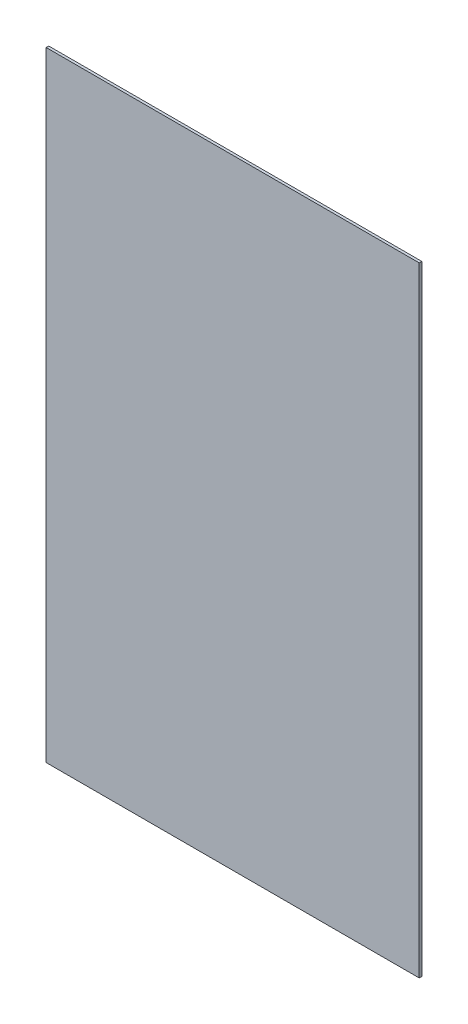
ISO-10303-21;
HEADER;
FILE_DESCRIPTION(('STEP AP214'),'2;1');
FILE_NAME('part.step','',(''),(''),'','','');
FILE_SCHEMA(('AUTOMOTIVE_DESIGN { 1 0 10303 214 1 1 1 1 }'));
ENDSEC;
DATA;
#1=APPLICATION_CONTEXT('core data for automotive mechanical design processes');
#2=APPLICATION_PROTOCOL_DEFINITION('international standard','automotive_design',2000,#1);
#3=PRODUCT_CONTEXT('',#1,'mechanical');
#4=PRODUCT('Part','Part','',(#3));
#5=PRODUCT_RELATED_PRODUCT_CATEGORY('part','',(#4));
#6=PRODUCT_DEFINITION_FORMATION('','',#4);
#7=PRODUCT_DEFINITION_CONTEXT('part definition',#1,'design');
#8=PRODUCT_DEFINITION('design','',#6,#7);
#9=PRODUCT_DEFINITION_SHAPE('','',#8);
#10=(LENGTH_UNIT() NAMED_UNIT(*) SI_UNIT(.MILLI.,.METRE.));
#11=(NAMED_UNIT(*) PLANE_ANGLE_UNIT() SI_UNIT($,.RADIAN.));
#12=(NAMED_UNIT(*) SI_UNIT($,.STERADIAN.) SOLID_ANGLE_UNIT());
#13=UNCERTAINTY_MEASURE_WITH_UNIT(LENGTH_MEASURE(1.E-05),#10,'distance_accuracy_value','');
#14=(GEOMETRIC_REPRESENTATION_CONTEXT(3) GLOBAL_UNCERTAINTY_ASSIGNED_CONTEXT((#13)) GLOBAL_UNIT_ASSIGNED_CONTEXT((#10,
#11,#12)) REPRESENTATION_CONTEXT('',''));
#15=CARTESIAN_POINT('',(0.,0.,0.));
#16=DIRECTION('',(0.,0.,1.));
#17=DIRECTION('',(1.,0.,0.));
#18=AXIS2_PLACEMENT_3D('',#15,#16,#17);
#19=CARTESIAN_POINT('',(0.,0.,3.175));
#20=DIRECTION('',(1.,0.,0.));
#21=DIRECTION('',(0.,0.,-1.));
#22=AXIS2_PLACEMENT_3D('',#19,#20,#21);
#23=PLANE('',#22);
#24=DIRECTION('',(0.,-1.,0.));
#25=VECTOR('',#24,1.);
#26=CARTESIAN_POINT('',(0.,0.,0.));
#27=LINE('',#26,#25);
#28=CARTESIAN_POINT('',(0.,758.9266,0.));
#29=VERTEX_POINT('',#28);
#30=CARTESIAN_POINT('',(0.,0.,0.));
#31=VERTEX_POINT('',#30);
#32=EDGE_CURVE('E96',#29,#31,#27,.T.);
#33=ORIENTED_EDGE('',*,*,#32,.T.);
#34=DIRECTION('',(0.,0.,-1.));
#35=VECTOR('',#34,1.);
#36=CARTESIAN_POINT('',(0.,0.,3.175));
#37=LINE('',#36,#35);
#38=CARTESIAN_POINT('',(0.,0.,3.175));
#39=VERTEX_POINT('',#38);
#40=EDGE_CURVE('E11',#39,#31,#37,.T.);
#41=ORIENTED_EDGE('',*,*,#40,.F.);
#42=DIRECTION('',(0.,-1.,0.));
#43=VECTOR('',#42,1.);
#44=CARTESIAN_POINT('',(0.,0.,3.175));
#45=LINE('',#44,#43);
#46=CARTESIAN_POINT('',(0.,758.9266,3.175));
#47=VERTEX_POINT('',#46);
#48=EDGE_CURVE('E84',#47,#39,#45,.T.);
#49=ORIENTED_EDGE('',*,*,#48,.F.);
#50=DIRECTION('',(0.,0.,-1.));
#51=VECTOR('',#50,1.);
#52=CARTESIAN_POINT('',(0.,758.9266,3.175));
#53=LINE('',#52,#51);
#54=EDGE_CURVE('E92',#47,#29,#53,.T.);
#55=ORIENTED_EDGE('',*,*,#54,.T.);
#56=EDGE_LOOP('',(#33,#41,#49,#55));
#57=FACE_BOUND('',#56,.T.);
#58=ADVANCED_FACE('F33',(#57),#23,.F.);
#59=CARTESIAN_POINT('',(0.,0.,3.175));
#60=DIRECTION('',(0.,1.,0.));
#61=DIRECTION('',(0.,0.,1.));
#62=AXIS2_PLACEMENT_3D('',#59,#60,#61);
#63=PLANE('',#62);
#64=DIRECTION('',(1.,0.,0.));
#65=VECTOR('',#64,1.);
#66=CARTESIAN_POINT('',(0.,0.,0.));
#67=LINE('',#66,#65);
#68=CARTESIAN_POINT('',(457.2,0.,0.));
#69=VERTEX_POINT('',#68);
#70=EDGE_CURVE('E88',#31,#69,#67,.T.);
#71=ORIENTED_EDGE('',*,*,#70,.T.);
#72=DIRECTION('',(0.,0.,-1.));
#73=VECTOR('',#72,1.);
#74=CARTESIAN_POINT('',(457.2,0.,3.175));
#75=LINE('',#74,#73);
#76=CARTESIAN_POINT('',(457.2,0.,3.175));
#77=VERTEX_POINT('',#76);
#78=EDGE_CURVE('E41',#77,#69,#75,.T.);
#79=ORIENTED_EDGE('',*,*,#78,.F.);
#80=DIRECTION('',(1.,0.,0.));
#81=VECTOR('',#80,1.);
#82=CARTESIAN_POINT('',(0.,0.,3.175));
#83=LINE('',#82,#81);
#84=EDGE_CURVE('E79',#39,#77,#83,.T.);
#85=ORIENTED_EDGE('',*,*,#84,.F.);
#86=ORIENTED_EDGE('',*,*,#40,.T.);
#87=EDGE_LOOP('',(#71,#79,#85,#86));
#88=FACE_BOUND('',#87,.T.);
#89=ADVANCED_FACE('F87',(#88),#63,.F.);
#90=CARTESIAN_POINT('',(457.2,0.,3.175));
#91=DIRECTION('',(-1.,0.,0.));
#92=DIRECTION('',(0.,0.,1.));
#93=AXIS2_PLACEMENT_3D('',#90,#91,#92);
#94=PLANE('',#93);
#95=DIRECTION('',(0.,1.,0.));
#96=VECTOR('',#95,1.);
#97=CARTESIAN_POINT('',(457.2,0.,0.));
#98=LINE('',#97,#96);
#99=CARTESIAN_POINT('',(457.2,758.9266,0.));
#100=VERTEX_POINT('',#99);
#101=EDGE_CURVE('E66',#69,#100,#98,.T.);
#102=ORIENTED_EDGE('',*,*,#101,.T.);
#103=DIRECTION('',(0.,0.,-1.));
#104=VECTOR('',#103,1.);
#105=CARTESIAN_POINT('',(457.2,758.9266,3.175));
#106=LINE('',#105,#104);
#107=CARTESIAN_POINT('',(457.2,758.9266,3.175));
#108=VERTEX_POINT('',#107);
#109=EDGE_CURVE('E89',#108,#100,#106,.T.);
#110=ORIENTED_EDGE('',*,*,#109,.F.);
#111=DIRECTION('',(0.,1.,0.));
#112=VECTOR('',#111,1.);
#113=CARTESIAN_POINT('',(457.2,0.,3.175));
#114=LINE('',#113,#112);
#115=EDGE_CURVE('E82',#77,#108,#114,.T.);
#116=ORIENTED_EDGE('',*,*,#115,.F.);
#117=ORIENTED_EDGE('',*,*,#78,.T.);
#118=EDGE_LOOP('',(#102,#110,#116,#117));
#119=FACE_BOUND('',#118,.T.);
#120=ADVANCED_FACE('F90',(#119),#94,.F.);
#121=CARTESIAN_POINT('',(0.,758.9266,3.175));
#122=DIRECTION('',(0.,-1.,0.));
#123=DIRECTION('',(0.,0.,-1.));
#124=AXIS2_PLACEMENT_3D('',#121,#122,#123);
#125=PLANE('',#124);
#126=DIRECTION('',(-1.,0.,0.));
#127=VECTOR('',#126,1.);
#128=CARTESIAN_POINT('',(0.,758.9266,0.));
#129=LINE('',#128,#127);
#130=EDGE_CURVE('E72',#100,#29,#129,.T.);
#131=ORIENTED_EDGE('',*,*,#130,.T.);
#132=ORIENTED_EDGE('',*,*,#54,.F.);
#133=DIRECTION('',(-1.,0.,0.));
#134=VECTOR('',#133,1.);
#135=CARTESIAN_POINT('',(0.,758.9266,3.175));
#136=LINE('',#135,#134);
#137=EDGE_CURVE('E49',#108,#47,#136,.T.);
#138=ORIENTED_EDGE('',*,*,#137,.F.);
#139=ORIENTED_EDGE('',*,*,#109,.T.);
#140=EDGE_LOOP('',(#131,#132,#138,#139));
#141=FACE_BOUND('',#140,.T.);
#142=ADVANCED_FACE('F103',(#141),#125,.F.);
#143=CARTESIAN_POINT('',(0.,0.,3.175));
#144=DIRECTION('',(0.,0.,-1.));
#145=DIRECTION('',(-1.,0.,0.));
#146=AXIS2_PLACEMENT_3D('',#143,#144,#145);
#147=PLANE('',#146);
#148=ORIENTED_EDGE('',*,*,#48,.T.);
#149=ORIENTED_EDGE('',*,*,#84,.T.);
#150=ORIENTED_EDGE('',*,*,#115,.T.);
#151=ORIENTED_EDGE('',*,*,#137,.T.);
#152=EDGE_LOOP('',(#148,#149,#150,#151));
#153=FACE_BOUND('',#152,.T.);
#154=ADVANCED_FACE('F80',(#153),#147,.F.);
#155=CARTESIAN_POINT('',(0.,0.,0.));
#156=DIRECTION('',(0.,0.,-1.));
#157=DIRECTION('',(-1.,0.,0.));
#158=AXIS2_PLACEMENT_3D('',#155,#156,#157);
#159=PLANE('',#158);
#160=ORIENTED_EDGE('',*,*,#32,.F.);
#161=ORIENTED_EDGE('',*,*,#130,.F.);
#162=ORIENTED_EDGE('',*,*,#101,.F.);
#163=ORIENTED_EDGE('',*,*,#70,.F.);
#164=EDGE_LOOP('',(#160,#161,#162,#163));
#165=FACE_BOUND('',#164,.T.);
#166=ADVANCED_FACE('F106',(#165),#159,.T.);
#167=CLOSED_SHELL('',(#58,#89,#120,#142,#154,#166));
#168=MANIFOLD_SOLID_BREP('B2',#167);
#169=ADVANCED_BREP_SHAPE_REPRESENTATION('',(#18,#168),#14);
#170=SHAPE_DEFINITION_REPRESENTATION(#9,#169);
ENDSEC;
END-ISO-10303-21;
